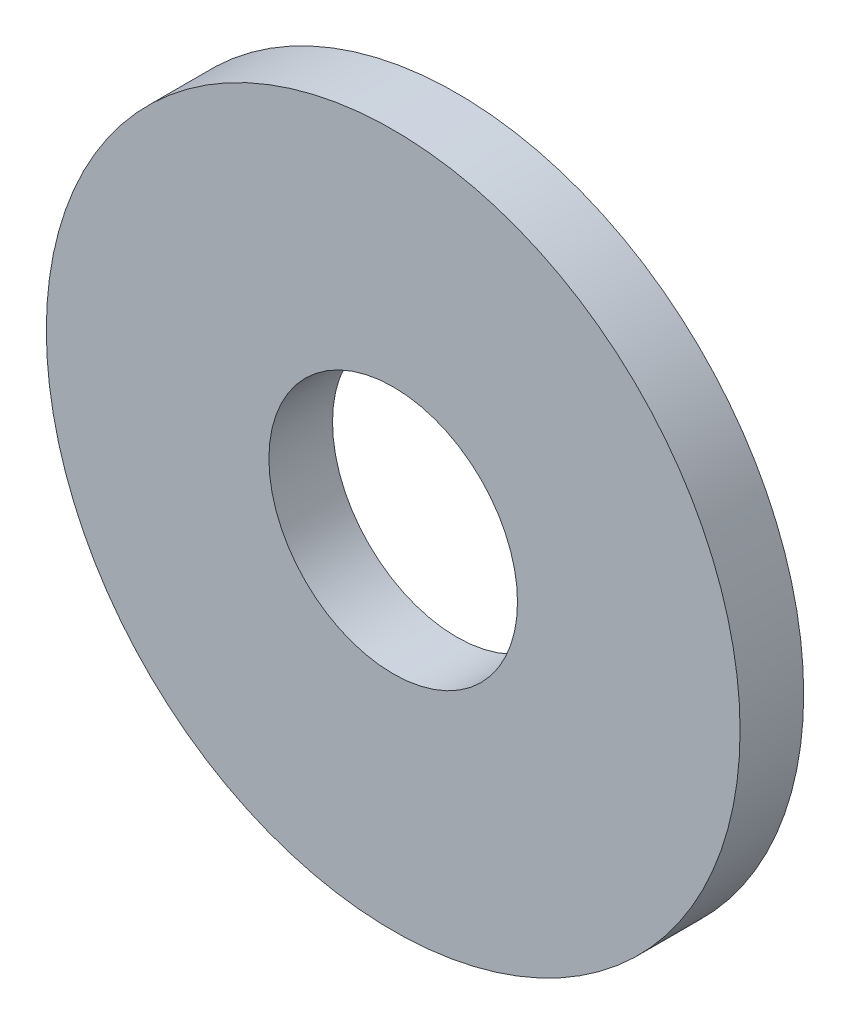
ISO-10303-21;
HEADER;
FILE_DESCRIPTION(('STEP AP214'),'2;1');
FILE_NAME('part.step','',(''),(''),'','','');
FILE_SCHEMA(('AUTOMOTIVE_DESIGN { 1 0 10303 214 1 1 1 1 }'));
ENDSEC;
DATA;
#1=APPLICATION_CONTEXT('core data for automotive mechanical design processes');
#2=APPLICATION_PROTOCOL_DEFINITION('international standard','automotive_design',2000,#1);
#3=PRODUCT_CONTEXT('',#1,'mechanical');
#4=PRODUCT('Part','Part','',(#3));
#5=PRODUCT_RELATED_PRODUCT_CATEGORY('part','',(#4));
#6=PRODUCT_DEFINITION_FORMATION('','',#4);
#7=PRODUCT_DEFINITION_CONTEXT('part definition',#1,'design');
#8=PRODUCT_DEFINITION('design','',#6,#7);
#9=PRODUCT_DEFINITION_SHAPE('','',#8);
#10=(LENGTH_UNIT() NAMED_UNIT(*) SI_UNIT(.MILLI.,.METRE.));
#11=(NAMED_UNIT(*) PLANE_ANGLE_UNIT() SI_UNIT($,.RADIAN.));
#12=(NAMED_UNIT(*) SI_UNIT($,.STERADIAN.) SOLID_ANGLE_UNIT());
#13=UNCERTAINTY_MEASURE_WITH_UNIT(LENGTH_MEASURE(1.E-05),#10,'distance_accuracy_value','');
#14=(GEOMETRIC_REPRESENTATION_CONTEXT(3) GLOBAL_UNCERTAINTY_ASSIGNED_CONTEXT((#13)) GLOBAL_UNIT_ASSIGNED_CONTEXT((#10,
#11,#12)) REPRESENTATION_CONTEXT('',''));
#15=CARTESIAN_POINT('',(0.,0.,0.));
#16=DIRECTION('',(0.,0.,1.));
#17=DIRECTION('',(1.,0.,0.));
#18=AXIS2_PLACEMENT_3D('',#15,#16,#17);
#19=CARTESIAN_POINT('',(0.,0.,1.1));
#20=DIRECTION('',(0.,0.,1.));
#21=DIRECTION('',(1.,0.,0.));
#22=AXIS2_PLACEMENT_3D('',#19,#20,#21);
#23=PLANE('',#22);
#24=CARTESIAN_POINT('',(0.,0.,1.1));
#25=DIRECTION('',(0.,0.,1.));
#26=DIRECTION('',(1.,0.,0.));
#27=AXIS2_PLACEMENT_3D('',#24,#25,#26);
#28=CIRCLE('',#27,6.);
#29=CARTESIAN_POINT('',(6.,0.,1.1));
#30=VERTEX_POINT('',#29);
#31=EDGE_CURVE('E10',#30,#30,#28,.T.);
#32=ORIENTED_EDGE('',*,*,#31,.T.);
#33=EDGE_LOOP('',(#32));
#34=FACE_BOUND('',#33,.T.);
#35=CARTESIAN_POINT('',(0.,0.,1.1));
#36=DIRECTION('',(0.,0.,1.));
#37=DIRECTION('',(1.,0.,0.));
#38=AXIS2_PLACEMENT_3D('',#35,#36,#37);
#39=CIRCLE('',#38,2.15);
#40=CARTESIAN_POINT('',(2.15,0.,1.1));
#41=VERTEX_POINT('',#40);
#42=EDGE_CURVE('E45',#41,#41,#39,.T.);
#43=ORIENTED_EDGE('',*,*,#42,.F.);
#44=EDGE_LOOP('',(#43));
#45=FACE_BOUND('',#44,.T.);
#46=ADVANCED_FACE('F34',(#34,#45),#23,.T.);
#47=CARTESIAN_POINT('',(0.,0.,0.));
#48=DIRECTION('',(0.,0.,1.));
#49=DIRECTION('',(1.,0.,0.));
#50=AXIS2_PLACEMENT_3D('',#47,#48,#49);
#51=PLANE('',#50);
#52=CARTESIAN_POINT('',(0.,0.,0.));
#53=DIRECTION('',(0.,0.,1.));
#54=DIRECTION('',(1.,0.,0.));
#55=AXIS2_PLACEMENT_3D('',#52,#53,#54);
#56=CIRCLE('',#55,6.);
#57=CARTESIAN_POINT('',(6.,0.,0.));
#58=VERTEX_POINT('',#57);
#59=EDGE_CURVE('E38',#58,#58,#56,.T.);
#60=ORIENTED_EDGE('',*,*,#59,.F.);
#61=EDGE_LOOP('',(#60));
#62=FACE_BOUND('',#61,.T.);
#63=CARTESIAN_POINT('',(0.,0.,0.));
#64=DIRECTION('',(0.,0.,1.));
#65=DIRECTION('',(1.,0.,0.));
#66=AXIS2_PLACEMENT_3D('',#63,#64,#65);
#67=CIRCLE('',#66,2.15);
#68=CARTESIAN_POINT('',(2.15,0.,0.));
#69=VERTEX_POINT('',#68);
#70=EDGE_CURVE('E47',#69,#69,#67,.T.);
#71=ORIENTED_EDGE('',*,*,#70,.T.);
#72=EDGE_LOOP('',(#71));
#73=FACE_BOUND('',#72,.T.);
#74=ADVANCED_FACE('F57',(#62,#73),#51,.F.);
#75=CARTESIAN_POINT('',(0.,0.,1.1));
#76=DIRECTION('',(0.,0.,-1.));
#77=DIRECTION('',(-1.,0.,0.));
#78=AXIS2_PLACEMENT_3D('',#75,#76,#77);
#79=CYLINDRICAL_SURFACE('',#78,6.);
#80=ORIENTED_EDGE('',*,*,#31,.F.);
#81=EDGE_LOOP('',(#80));
#82=FACE_BOUND('',#81,.T.);
#83=ORIENTED_EDGE('',*,*,#59,.T.);
#84=EDGE_LOOP('',(#83));
#85=FACE_BOUND('',#84,.T.);
#86=ADVANCED_FACE('F36',(#82,#85),#79,.T.);
#87=CARTESIAN_POINT('',(0.,0.,1.1));
#88=DIRECTION('',(0.,0.,-1.));
#89=DIRECTION('',(-1.,0.,0.));
#90=AXIS2_PLACEMENT_3D('',#87,#88,#89);
#91=CYLINDRICAL_SURFACE('',#90,2.15);
#92=ORIENTED_EDGE('',*,*,#42,.T.);
#93=EDGE_LOOP('',(#92));
#94=FACE_BOUND('',#93,.T.);
#95=ORIENTED_EDGE('',*,*,#70,.F.);
#96=EDGE_LOOP('',(#95));
#97=FACE_BOUND('',#96,.T.);
#98=ADVANCED_FACE('F53',(#94,#97),#91,.F.);
#99=CLOSED_SHELL('',(#46,#74,#86,#98));
#100=MANIFOLD_SOLID_BREP('B2',#99);
#101=ADVANCED_BREP_SHAPE_REPRESENTATION('',(#18,#100),#14);
#102=SHAPE_DEFINITION_REPRESENTATION(#9,#101);
ENDSEC;
END-ISO-10303-21;
